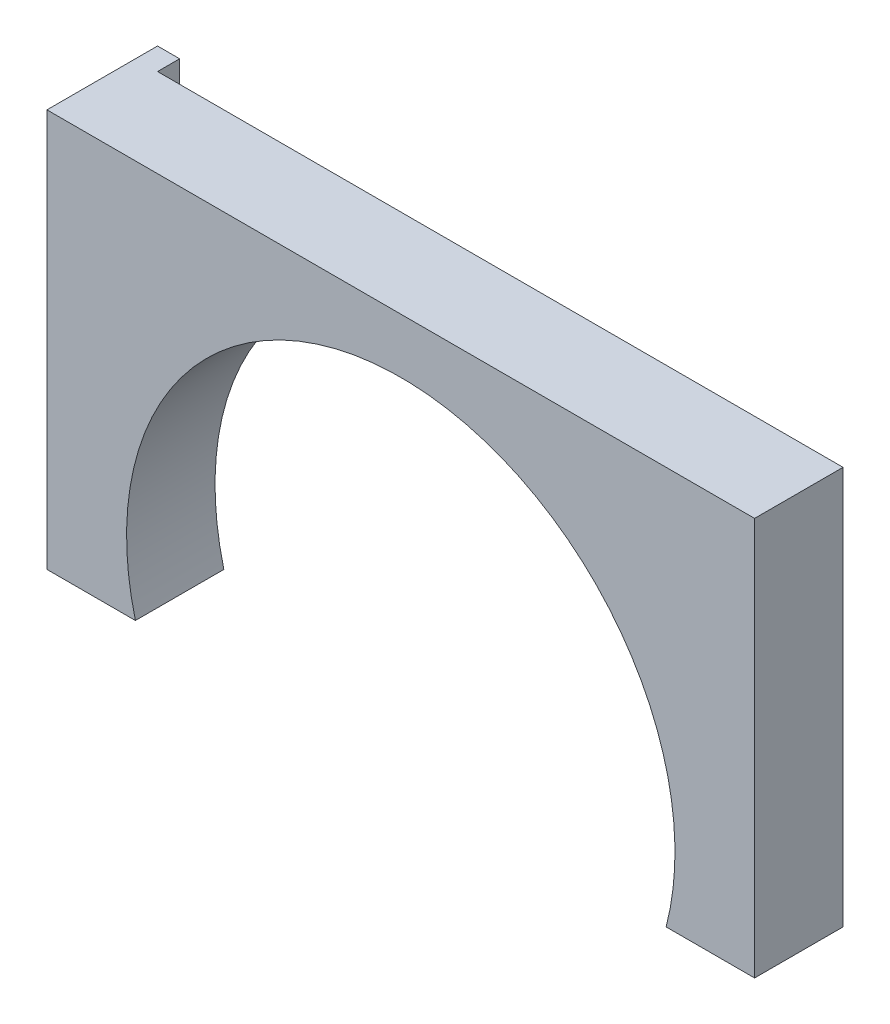
ISO-10303-21;
HEADER;
FILE_DESCRIPTION(('STEP AP214'),'2;1');
FILE_NAME('part.step','',(''),(''),'','','');
FILE_SCHEMA(('AUTOMOTIVE_DESIGN { 1 0 10303 214 1 1 1 1 }'));
ENDSEC;
DATA;
#1=APPLICATION_CONTEXT('core data for automotive mechanical design processes');
#2=APPLICATION_PROTOCOL_DEFINITION('international standard','automotive_design',2000,#1);
#3=PRODUCT_CONTEXT('',#1,'mechanical');
#4=PRODUCT('Part','Part','',(#3));
#5=PRODUCT_RELATED_PRODUCT_CATEGORY('part','',(#4));
#6=PRODUCT_DEFINITION_FORMATION('','',#4);
#7=PRODUCT_DEFINITION_CONTEXT('part definition',#1,'design');
#8=PRODUCT_DEFINITION('design','',#6,#7);
#9=PRODUCT_DEFINITION_SHAPE('','',#8);
#10=(LENGTH_UNIT() NAMED_UNIT(*) SI_UNIT(.MILLI.,.METRE.));
#11=(NAMED_UNIT(*) PLANE_ANGLE_UNIT() SI_UNIT($,.RADIAN.));
#12=(NAMED_UNIT(*) SI_UNIT($,.STERADIAN.) SOLID_ANGLE_UNIT());
#13=UNCERTAINTY_MEASURE_WITH_UNIT(LENGTH_MEASURE(1.E-05),#10,'distance_accuracy_value','');
#14=(GEOMETRIC_REPRESENTATION_CONTEXT(3) GLOBAL_UNCERTAINTY_ASSIGNED_CONTEXT((#13)) GLOBAL_UNIT_ASSIGNED_CONTEXT((#10,
#11,#12)) REPRESENTATION_CONTEXT('',''));
#15=CARTESIAN_POINT('',(0.,0.,0.));
#16=DIRECTION('',(0.,0.,1.));
#17=DIRECTION('',(1.,0.,0.));
#18=AXIS2_PLACEMENT_3D('',#15,#16,#17);
#19=CARTESIAN_POINT('',(0.,0.,0.));
#20=DIRECTION('',(0.,0.,1.));
#21=DIRECTION('',(1.,0.,0.));
#22=AXIS2_PLACEMENT_3D('',#19,#20,#21);
#23=PLANE('',#22);
#24=DIRECTION('',(0.,-1.,0.));
#25=VECTOR('',#24,1.);
#26=CARTESIAN_POINT('',(-75.,74.3795006481867,0.));
#27=LINE('',#26,#25);
#28=CARTESIAN_POINT('',(-75.,74.3795006481867,0.));
#29=VERTEX_POINT('',#28);
#30=CARTESIAN_POINT('',(-75.,-15.6204993518133,0.));
#31=VERTEX_POINT('',#30);
#32=EDGE_CURVE('E48',#29,#31,#27,.T.);
#33=ORIENTED_EDGE('',*,*,#32,.F.);
#34=DIRECTION('',(-1.,0.,0.));
#35=VECTOR('',#34,1.);
#36=CARTESIAN_POINT('',(-80.,74.3795006481867,0.));
#37=LINE('',#36,#35);
#38=CARTESIAN_POINT('',(80.,74.3795006481867,0.));
#39=VERTEX_POINT('',#38);
#40=EDGE_CURVE('E124',#39,#29,#37,.T.);
#41=ORIENTED_EDGE('',*,*,#40,.F.);
#42=DIRECTION('',(0.,1.,0.));
#43=VECTOR('',#42,1.);
#44=CARTESIAN_POINT('',(80.,74.3795006481867,0.));
#45=LINE('',#44,#43);
#46=CARTESIAN_POINT('',(80.,-15.6204993518133,0.));
#47=VERTEX_POINT('',#46);
#48=EDGE_CURVE('E78',#47,#39,#45,.T.);
#49=ORIENTED_EDGE('',*,*,#48,.F.);
#50=DIRECTION('',(1.,0.,0.));
#51=VECTOR('',#50,1.);
#52=CARTESIAN_POINT('',(60.,-15.6204993518133,0.));
#53=LINE('',#52,#51);
#54=CARTESIAN_POINT('',(60.,-15.6204993518133,0.));
#55=VERTEX_POINT('',#54);
#56=EDGE_CURVE('E130',#55,#47,#53,.T.);
#57=ORIENTED_EDGE('',*,*,#56,.F.);
#58=CARTESIAN_POINT('',(0.,0.,0.));
#59=DIRECTION('',(0.,0.,-1.));
#60=DIRECTION('',(1.,0.,0.));
#61=AXIS2_PLACEMENT_3D('',#58,#59,#60);
#62=CIRCLE('',#61,62.);
#63=CARTESIAN_POINT('',(-60.,-15.6204993518133,0.));
#64=VERTEX_POINT('',#63);
#65=EDGE_CURVE('E112',#64,#55,#62,.T.);
#66=ORIENTED_EDGE('',*,*,#65,.F.);
#67=DIRECTION('',(1.,0.,0.));
#68=VECTOR('',#67,1.);
#69=CARTESIAN_POINT('',(-60.,-15.6204993518133,0.));
#70=LINE('',#69,#68);
#71=EDGE_CURVE('E126',#31,#64,#70,.T.);
#72=ORIENTED_EDGE('',*,*,#71,.F.);
#73=EDGE_LOOP('',(#33,#41,#49,#57,#66,#72));
#74=FACE_BOUND('',#73,.T.);
#75=ADVANCED_FACE('F33',(#74),#23,.F.);
#76=CARTESIAN_POINT('',(-80.,74.3795006481867,20.));
#77=DIRECTION('',(0.,-1.,0.));
#78=DIRECTION('',(0.,0.,-1.));
#79=AXIS2_PLACEMENT_3D('',#76,#77,#78);
#80=PLANE('',#79);
#81=ORIENTED_EDGE('',*,*,#40,.T.);
#82=DIRECTION('',(0.,0.,1.));
#83=VECTOR('',#82,1.);
#84=CARTESIAN_POINT('',(-75.,74.3795006481867,-5.));
#85=LINE('',#84,#83);
#86=CARTESIAN_POINT('',(-75.,74.3795006481867,-5.));
#87=VERTEX_POINT('',#86);
#88=EDGE_CURVE('E127',#87,#29,#85,.T.);
#89=ORIENTED_EDGE('',*,*,#88,.F.);
#90=DIRECTION('',(1.,0.,0.));
#91=VECTOR('',#90,1.);
#92=CARTESIAN_POINT('',(-80.,74.3795006481867,-5.));
#93=LINE('',#92,#91);
#94=CARTESIAN_POINT('',(-80.,74.3795006481867,-5.));
#95=VERTEX_POINT('',#94);
#96=EDGE_CURVE('E160',#95,#87,#93,.T.);
#97=ORIENTED_EDGE('',*,*,#96,.F.);
#98=DIRECTION('',(0.,0.,-1.));
#99=VECTOR('',#98,1.);
#100=CARTESIAN_POINT('',(-80.,74.3795006481867,20.));
#101=LINE('',#100,#99);
#102=CARTESIAN_POINT('',(-80.,74.3795006481867,20.));
#103=VERTEX_POINT('',#102);
#104=EDGE_CURVE('E11',#103,#95,#101,.T.);
#105=ORIENTED_EDGE('',*,*,#104,.F.);
#106=DIRECTION('',(-1.,0.,0.));
#107=VECTOR('',#106,1.);
#108=CARTESIAN_POINT('',(-80.,74.3795006481867,20.));
#109=LINE('',#108,#107);
#110=CARTESIAN_POINT('',(80.,74.3795006481867,20.));
#111=VERTEX_POINT('',#110);
#112=EDGE_CURVE('E133',#111,#103,#109,.T.);
#113=ORIENTED_EDGE('',*,*,#112,.F.);
#114=DIRECTION('',(0.,0.,-1.));
#115=VECTOR('',#114,1.);
#116=CARTESIAN_POINT('',(80.,74.3795006481867,20.));
#117=LINE('',#116,#115);
#118=EDGE_CURVE('E120',#111,#39,#117,.T.);
#119=ORIENTED_EDGE('',*,*,#118,.T.);
#120=EDGE_LOOP('',(#81,#89,#97,#105,#113,#119));
#121=FACE_BOUND('',#120,.T.);
#122=ADVANCED_FACE('F35',(#121),#80,.F.);
#123=CARTESIAN_POINT('',(-80.,74.3795006481867,20.));
#124=DIRECTION('',(1.,0.,0.));
#125=DIRECTION('',(0.,1.,0.));
#126=AXIS2_PLACEMENT_3D('',#123,#124,#125);
#127=PLANE('',#126);
#128=ORIENTED_EDGE('',*,*,#104,.T.);
#129=DIRECTION('',(0.,1.,0.));
#130=VECTOR('',#129,1.);
#131=CARTESIAN_POINT('',(-80.,74.3795006481867,-5.));
#132=LINE('',#131,#130);
#133=CARTESIAN_POINT('',(-80.,-15.6204993518133,-5.));
#134=VERTEX_POINT('',#133);
#135=EDGE_CURVE('E151',#134,#95,#132,.T.);
#136=ORIENTED_EDGE('',*,*,#135,.F.);
#137=DIRECTION('',(0.,0.,-1.));
#138=VECTOR('',#137,1.);
#139=CARTESIAN_POINT('',(-80.,-15.6204993518133,20.));
#140=LINE('',#139,#138);
#141=CARTESIAN_POINT('',(-80.,-15.6204993518133,20.));
#142=VERTEX_POINT('',#141);
#143=EDGE_CURVE('E41',#142,#134,#140,.T.);
#144=ORIENTED_EDGE('',*,*,#143,.F.);
#145=DIRECTION('',(0.,-1.,0.));
#146=VECTOR('',#145,1.);
#147=CARTESIAN_POINT('',(-80.,74.3795006481867,20.));
#148=LINE('',#147,#146);
#149=EDGE_CURVE('E86',#103,#142,#148,.T.);
#150=ORIENTED_EDGE('',*,*,#149,.F.);
#151=EDGE_LOOP('',(#128,#136,#144,#150));
#152=FACE_BOUND('',#151,.T.);
#153=ADVANCED_FACE('F157',(#152),#127,.F.);
#154=CARTESIAN_POINT('',(-60.,-15.6204993518133,20.));
#155=DIRECTION('',(0.,1.,0.));
#156=DIRECTION('',(-1.,0.,0.));
#157=AXIS2_PLACEMENT_3D('',#154,#155,#156);
#158=PLANE('',#157);
#159=ORIENTED_EDGE('',*,*,#143,.T.);
#160=DIRECTION('',(-1.,0.,0.));
#161=VECTOR('',#160,1.);
#162=CARTESIAN_POINT('',(-80.,-15.6204993518133,-5.));
#163=LINE('',#162,#161);
#164=CARTESIAN_POINT('',(-75.,-15.6204993518133,-5.));
#165=VERTEX_POINT('',#164);
#166=EDGE_CURVE('E143',#165,#134,#163,.T.);
#167=ORIENTED_EDGE('',*,*,#166,.F.);
#168=DIRECTION('',(0.,0.,1.));
#169=VECTOR('',#168,1.);
#170=CARTESIAN_POINT('',(-75.,-15.6204993518133,-5.));
#171=LINE('',#170,#169);
#172=EDGE_CURVE('E155',#165,#31,#171,.T.);
#173=ORIENTED_EDGE('',*,*,#172,.T.);
#174=ORIENTED_EDGE('',*,*,#71,.T.);
#175=DIRECTION('',(0.,0.,-1.));
#176=VECTOR('',#175,1.);
#177=CARTESIAN_POINT('',(-60.,-15.6204993518133,20.));
#178=LINE('',#177,#176);
#179=CARTESIAN_POINT('',(-60.,-15.6204993518133,20.));
#180=VERTEX_POINT('',#179);
#181=EDGE_CURVE('E115',#180,#64,#178,.T.);
#182=ORIENTED_EDGE('',*,*,#181,.F.);
#183=DIRECTION('',(1.,0.,0.));
#184=VECTOR('',#183,1.);
#185=CARTESIAN_POINT('',(-60.,-15.6204993518133,20.));
#186=LINE('',#185,#184);
#187=EDGE_CURVE('E103',#142,#180,#186,.T.);
#188=ORIENTED_EDGE('',*,*,#187,.F.);
#189=EDGE_LOOP('',(#159,#167,#173,#174,#182,#188));
#190=FACE_BOUND('',#189,.T.);
#191=ADVANCED_FACE('F140',(#190),#158,.F.);
#192=CARTESIAN_POINT('',(0.,0.,20.));
#193=DIRECTION('',(0.,0.,-1.));
#194=DIRECTION('',(-1.,0.,0.));
#195=AXIS2_PLACEMENT_3D('',#192,#193,#194);
#196=CYLINDRICAL_SURFACE('',#195,62.);
#197=ORIENTED_EDGE('',*,*,#65,.T.);
#198=DIRECTION('',(0.,0.,-1.));
#199=VECTOR('',#198,1.);
#200=CARTESIAN_POINT('',(60.,-15.6204993518133,20.));
#201=LINE('',#200,#199);
#202=CARTESIAN_POINT('',(60.,-15.6204993518133,20.));
#203=VERTEX_POINT('',#202);
#204=EDGE_CURVE('E109',#203,#55,#201,.T.);
#205=ORIENTED_EDGE('',*,*,#204,.F.);
#206=CARTESIAN_POINT('',(0.,0.,20.));
#207=DIRECTION('',(0.,0.,-1.));
#208=DIRECTION('',(1.,0.,0.));
#209=AXIS2_PLACEMENT_3D('',#206,#207,#208);
#210=CIRCLE('',#209,62.);
#211=EDGE_CURVE('E96',#180,#203,#210,.T.);
#212=ORIENTED_EDGE('',*,*,#211,.F.);
#213=ORIENTED_EDGE('',*,*,#181,.T.);
#214=EDGE_LOOP('',(#197,#205,#212,#213));
#215=FACE_BOUND('',#214,.T.);
#216=ADVANCED_FACE('F110',(#215),#196,.F.);
#217=CARTESIAN_POINT('',(60.,-15.6204993518133,20.));
#218=DIRECTION('',(0.,1.,0.));
#219=DIRECTION('',(0.,0.,1.));
#220=AXIS2_PLACEMENT_3D('',#217,#218,#219);
#221=PLANE('',#220);
#222=ORIENTED_EDGE('',*,*,#56,.T.);
#223=DIRECTION('',(0.,0.,-1.));
#224=VECTOR('',#223,1.);
#225=CARTESIAN_POINT('',(80.,-15.6204993518133,20.));
#226=LINE('',#225,#224);
#227=CARTESIAN_POINT('',(80.,-15.6204993518133,20.));
#228=VERTEX_POINT('',#227);
#229=EDGE_CURVE('E116',#228,#47,#226,.T.);
#230=ORIENTED_EDGE('',*,*,#229,.F.);
#231=DIRECTION('',(1.,0.,0.));
#232=VECTOR('',#231,1.);
#233=CARTESIAN_POINT('',(60.,-15.6204993518133,20.));
#234=LINE('',#233,#232);
#235=EDGE_CURVE('E100',#203,#228,#234,.T.);
#236=ORIENTED_EDGE('',*,*,#235,.F.);
#237=ORIENTED_EDGE('',*,*,#204,.T.);
#238=EDGE_LOOP('',(#222,#230,#236,#237));
#239=FACE_BOUND('',#238,.T.);
#240=ADVANCED_FACE('F118',(#239),#221,.F.);
#241=CARTESIAN_POINT('',(80.,74.3795006481867,20.));
#242=DIRECTION('',(-1.,0.,0.));
#243=DIRECTION('',(0.,-1.,0.));
#244=AXIS2_PLACEMENT_3D('',#241,#242,#243);
#245=PLANE('',#244);
#246=ORIENTED_EDGE('',*,*,#48,.T.);
#247=ORIENTED_EDGE('',*,*,#118,.F.);
#248=DIRECTION('',(0.,1.,0.));
#249=VECTOR('',#248,1.);
#250=CARTESIAN_POINT('',(80.,74.3795006481867,20.));
#251=LINE('',#250,#249);
#252=EDGE_CURVE('E57',#228,#111,#251,.T.);
#253=ORIENTED_EDGE('',*,*,#252,.F.);
#254=ORIENTED_EDGE('',*,*,#229,.T.);
#255=EDGE_LOOP('',(#246,#247,#253,#254));
#256=FACE_BOUND('',#255,.T.);
#257=ADVANCED_FACE('F186',(#256),#245,.F.);
#258=CARTESIAN_POINT('',(0.,0.,20.));
#259=DIRECTION('',(0.,0.,1.));
#260=DIRECTION('',(1.,0.,0.));
#261=AXIS2_PLACEMENT_3D('',#258,#259,#260);
#262=PLANE('',#261);
#263=ORIENTED_EDGE('',*,*,#112,.T.);
#264=ORIENTED_EDGE('',*,*,#149,.T.);
#265=ORIENTED_EDGE('',*,*,#187,.T.);
#266=ORIENTED_EDGE('',*,*,#211,.T.);
#267=ORIENTED_EDGE('',*,*,#235,.T.);
#268=ORIENTED_EDGE('',*,*,#252,.T.);
#269=EDGE_LOOP('',(#263,#264,#265,#266,#267,#268));
#270=FACE_BOUND('',#269,.T.);
#271=ADVANCED_FACE('F98',(#270),#262,.T.);
#272=CARTESIAN_POINT('',(-75.,74.3795006481867,-5.));
#273=DIRECTION('',(-1.,0.,0.));
#274=DIRECTION('',(0.,-1.,0.));
#275=AXIS2_PLACEMENT_3D('',#272,#273,#274);
#276=PLANE('',#275);
#277=ORIENTED_EDGE('',*,*,#32,.T.);
#278=ORIENTED_EDGE('',*,*,#172,.F.);
#279=DIRECTION('',(0.,-1.,0.));
#280=VECTOR('',#279,1.);
#281=CARTESIAN_POINT('',(-75.,74.3795006481867,-5.));
#282=LINE('',#281,#280);
#283=EDGE_CURVE('E153',#87,#165,#282,.T.);
#284=ORIENTED_EDGE('',*,*,#283,.F.);
#285=ORIENTED_EDGE('',*,*,#88,.T.);
#286=EDGE_LOOP('',(#277,#278,#284,#285));
#287=FACE_BOUND('',#286,.T.);
#288=ADVANCED_FACE('F178',(#287),#276,.F.);
#289=CARTESIAN_POINT('',(0.,0.,-5.));
#290=DIRECTION('',(0.,0.,1.));
#291=DIRECTION('',(1.,0.,0.));
#292=AXIS2_PLACEMENT_3D('',#289,#290,#291);
#293=PLANE('',#292);
#294=ORIENTED_EDGE('',*,*,#135,.T.);
#295=ORIENTED_EDGE('',*,*,#96,.T.);
#296=ORIENTED_EDGE('',*,*,#283,.T.);
#297=ORIENTED_EDGE('',*,*,#166,.T.);
#298=EDGE_LOOP('',(#294,#295,#296,#297));
#299=FACE_BOUND('',#298,.T.);
#300=ADVANCED_FACE('F148',(#299),#293,.F.);
#301=CLOSED_SHELL('',(#75,#122,#153,#191,#216,#240,#257,#271,#288,#300));
#302=MANIFOLD_SOLID_BREP('B2',#301);
#303=ADVANCED_BREP_SHAPE_REPRESENTATION('',(#18,#302),#14);
#304=SHAPE_DEFINITION_REPRESENTATION(#9,#303);
ENDSEC;
END-ISO-10303-21;
